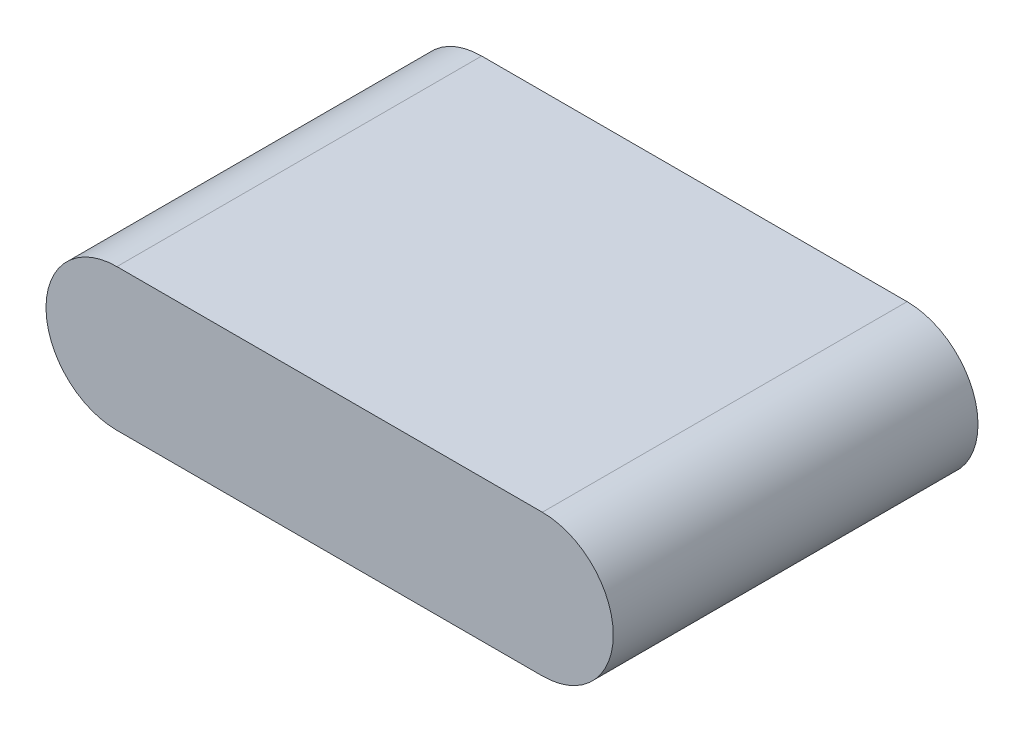
ISO-10303-21;
HEADER;
FILE_DESCRIPTION(('STEP AP214'),'2;1');
FILE_NAME('part.step','',(''),(''),'','','');
FILE_SCHEMA(('AUTOMOTIVE_DESIGN { 1 0 10303 214 1 1 1 1 }'));
ENDSEC;
DATA;
#1=APPLICATION_CONTEXT('core data for automotive mechanical design processes');
#2=APPLICATION_PROTOCOL_DEFINITION('international standard','automotive_design',2000,#1);
#3=PRODUCT_CONTEXT('',#1,'mechanical');
#4=PRODUCT('Part','Part','',(#3));
#5=PRODUCT_RELATED_PRODUCT_CATEGORY('part','',(#4));
#6=PRODUCT_DEFINITION_FORMATION('','',#4);
#7=PRODUCT_DEFINITION_CONTEXT('part definition',#1,'design');
#8=PRODUCT_DEFINITION('design','',#6,#7);
#9=PRODUCT_DEFINITION_SHAPE('','',#8);
#10=(LENGTH_UNIT() NAMED_UNIT(*) SI_UNIT(.MILLI.,.METRE.));
#11=(NAMED_UNIT(*) PLANE_ANGLE_UNIT() SI_UNIT($,.RADIAN.));
#12=(NAMED_UNIT(*) SI_UNIT($,.STERADIAN.) SOLID_ANGLE_UNIT());
#13=UNCERTAINTY_MEASURE_WITH_UNIT(LENGTH_MEASURE(1.E-05),#10,'distance_accuracy_value','');
#14=(GEOMETRIC_REPRESENTATION_CONTEXT(3) GLOBAL_UNCERTAINTY_ASSIGNED_CONTEXT((#13)) GLOBAL_UNIT_ASSIGNED_CONTEXT((#10,
#11,#12)) REPRESENTATION_CONTEXT('',''));
#15=CARTESIAN_POINT('',(0.,0.,0.));
#16=DIRECTION('',(0.,0.,1.));
#17=DIRECTION('',(1.,0.,0.));
#18=AXIS2_PLACEMENT_3D('',#15,#16,#17);
#19=CARTESIAN_POINT('',(5.427379671097,3.510809463321,0.));
#20=DIRECTION('',(0.,1.,0.));
#21=DIRECTION('',(0.,0.,1.));
#22=AXIS2_PLACEMENT_3D('',#19,#20,#21);
#23=PLANE('',#22);
#24=DIRECTION('',(1.,0.,0.));
#25=VECTOR('',#24,1.);
#26=CARTESIAN_POINT('',(5.369059671097,3.510809463321,0.1));
#27=LINE('',#26,#25);
#28=CARTESIAN_POINT('',(5.427379671097,3.510809463321,0.1));
#29=VERTEX_POINT('',#28);
#30=CARTESIAN_POINT('',(5.310739671097,3.510809463321,0.1));
#31=VERTEX_POINT('',#30);
#32=EDGE_CURVE('E84',#29,#31,#27,.F.);
#33=ORIENTED_EDGE('',*,*,#32,.F.);
#34=DIRECTION('',(0.,0.,1.));
#35=VECTOR('',#34,1.);
#36=CARTESIAN_POINT('',(5.427379671097,3.510809463321,0.));
#37=LINE('',#36,#35);
#38=CARTESIAN_POINT('',(5.427379671097,3.510809463321,0.));
#39=VERTEX_POINT('',#38);
#40=EDGE_CURVE('E64',#39,#29,#37,.T.);
#41=ORIENTED_EDGE('',*,*,#40,.F.);
#42=DIRECTION('',(1.,0.,0.));
#43=VECTOR('',#42,1.);
#44=CARTESIAN_POINT('',(5.369059671097,3.510809463321,0.));
#45=LINE('',#44,#43);
#46=CARTESIAN_POINT('',(5.310739671097,3.510809463321,0.));
#47=VERTEX_POINT('',#46);
#48=EDGE_CURVE('E61',#39,#47,#45,.F.);
#49=ORIENTED_EDGE('',*,*,#48,.T.);
#50=DIRECTION('',(0.,0.,1.));
#51=VECTOR('',#50,1.);
#52=CARTESIAN_POINT('',(5.310739671097,3.510809463321,0.));
#53=LINE('',#52,#51);
#54=EDGE_CURVE('E74',#31,#47,#53,.F.);
#55=ORIENTED_EDGE('',*,*,#54,.F.);
#56=EDGE_LOOP('',(#33,#41,#49,#55));
#57=FACE_BOUND('',#56,.T.);
#58=ADVANCED_FACE('F17',(#57),#23,.T.);
#59=CARTESIAN_POINT('',(5.369059671097,3.491369463321,0.));
#60=DIRECTION('',(0.,0.,1.));
#61=DIRECTION('',(1.,0.,0.));
#62=AXIS2_PLACEMENT_3D('',#59,#60,#61);
#63=PLANE('',#62);
#64=DIRECTION('',(1.,0.,0.));
#65=VECTOR('',#64,1.);
#66=CARTESIAN_POINT('',(5.310739671097,3.471929463321,0.));
#67=LINE('',#66,#65);
#68=CARTESIAN_POINT('',(5.310739671097,3.471929463321,0.));
#69=VERTEX_POINT('',#68);
#70=CARTESIAN_POINT('',(5.427379671097,3.471929463321,0.));
#71=VERTEX_POINT('',#70);
#72=EDGE_CURVE('E59',#69,#71,#67,.T.);
#73=ORIENTED_EDGE('',*,*,#72,.F.);
#74=CARTESIAN_POINT('',(5.310739671097,3.491369463321,0.));
#75=DIRECTION('',(0.,0.,1.));
#76=DIRECTION('',(1.,0.,0.));
#77=AXIS2_PLACEMENT_3D('',#74,#75,#76);
#78=CIRCLE('',#77,0.01944);
#79=EDGE_CURVE('E83',#47,#69,#78,.T.);
#80=ORIENTED_EDGE('',*,*,#79,.F.);
#81=ORIENTED_EDGE('',*,*,#48,.F.);
#82=CARTESIAN_POINT('',(5.427379671097,3.491369463321,0.));
#83=DIRECTION('',(0.,0.,1.));
#84=DIRECTION('',(1.,0.,0.));
#85=AXIS2_PLACEMENT_3D('',#82,#83,#84);
#86=CIRCLE('',#85,0.01944);
#87=EDGE_CURVE('E20',#71,#39,#86,.T.);
#88=ORIENTED_EDGE('',*,*,#87,.F.);
#89=EDGE_LOOP('',(#73,#80,#81,#88));
#90=FACE_BOUND('',#89,.T.);
#91=ADVANCED_FACE('F56',(#90),#63,.F.);
#92=CARTESIAN_POINT('',(5.427379671097,3.491369463321,0.));
#93=DIRECTION('',(0.,0.,1.));
#94=DIRECTION('',(1.,0.,0.));
#95=AXIS2_PLACEMENT_3D('',#92,#93,#94);
#96=CYLINDRICAL_SURFACE('',#95,0.01944);
#97=CARTESIAN_POINT('',(5.427379671097,3.491369463321,0.1));
#98=DIRECTION('',(0.,0.,1.));
#99=DIRECTION('',(1.,0.,0.));
#100=AXIS2_PLACEMENT_3D('',#97,#98,#99);
#101=CIRCLE('',#100,0.01944);
#102=CARTESIAN_POINT('',(5.427379671097,3.471929463321,0.1));
#103=VERTEX_POINT('',#102);
#104=EDGE_CURVE('E69',#103,#29,#101,.T.);
#105=ORIENTED_EDGE('',*,*,#104,.F.);
#106=DIRECTION('',(0.,0.,-1.));
#107=VECTOR('',#106,1.);
#108=CARTESIAN_POINT('',(5.427379671097,3.471929463321,0.));
#109=LINE('',#108,#107);
#110=EDGE_CURVE('E66',#71,#103,#109,.F.);
#111=ORIENTED_EDGE('',*,*,#110,.F.);
#112=ORIENTED_EDGE('',*,*,#87,.T.);
#113=ORIENTED_EDGE('',*,*,#40,.T.);
#114=EDGE_LOOP('',(#105,#111,#112,#113));
#115=FACE_BOUND('',#114,.T.);
#116=ADVANCED_FACE('F67',(#115),#96,.T.);
#117=CARTESIAN_POINT('',(5.369059671097,3.491369463321,0.1));
#118=DIRECTION('',(0.,0.,1.));
#119=DIRECTION('',(1.,0.,0.));
#120=AXIS2_PLACEMENT_3D('',#117,#118,#119);
#121=PLANE('',#120);
#122=CARTESIAN_POINT('',(5.310739671097,3.491369463321,0.1));
#123=DIRECTION('',(0.,0.,1.));
#124=DIRECTION('',(1.,0.,0.));
#125=AXIS2_PLACEMENT_3D('',#122,#123,#124);
#126=CIRCLE('',#125,0.01944);
#127=CARTESIAN_POINT('',(5.310739671097,3.471929463321,0.1));
#128=VERTEX_POINT('',#127);
#129=EDGE_CURVE('E35',#128,#31,#126,.F.);
#130=ORIENTED_EDGE('',*,*,#129,.F.);
#131=DIRECTION('',(1.,0.,0.));
#132=VECTOR('',#131,1.);
#133=CARTESIAN_POINT('',(5.310739671097,3.471929463321,0.1));
#134=LINE('',#133,#132);
#135=EDGE_CURVE('E26',#103,#128,#134,.F.);
#136=ORIENTED_EDGE('',*,*,#135,.F.);
#137=ORIENTED_EDGE('',*,*,#104,.T.);
#138=ORIENTED_EDGE('',*,*,#32,.T.);
#139=EDGE_LOOP('',(#130,#136,#137,#138));
#140=FACE_BOUND('',#139,.T.);
#141=ADVANCED_FACE('F88',(#140),#121,.T.);
#142=CARTESIAN_POINT('',(5.310739671097,3.491369463321,0.));
#143=DIRECTION('',(0.,0.,1.));
#144=DIRECTION('',(1.,0.,0.));
#145=AXIS2_PLACEMENT_3D('',#142,#143,#144);
#146=CYLINDRICAL_SURFACE('',#145,0.01944);
#147=ORIENTED_EDGE('',*,*,#129,.T.);
#148=ORIENTED_EDGE('',*,*,#54,.T.);
#149=ORIENTED_EDGE('',*,*,#79,.T.);
#150=DIRECTION('',(0.,0.,-1.));
#151=VECTOR('',#150,1.);
#152=CARTESIAN_POINT('',(5.310739671097,3.471929463321,0.));
#153=LINE('',#152,#151);
#154=EDGE_CURVE('E11',#128,#69,#153,.T.);
#155=ORIENTED_EDGE('',*,*,#154,.F.);
#156=EDGE_LOOP('',(#147,#148,#149,#155));
#157=FACE_BOUND('',#156,.T.);
#158=ADVANCED_FACE('F90',(#157),#146,.T.);
#159=CARTESIAN_POINT('',(5.310739671097,3.471929463321,0.));
#160=DIRECTION('',(0.,-1.,0.));
#161=DIRECTION('',(0.,0.,-1.));
#162=AXIS2_PLACEMENT_3D('',#159,#160,#161);
#163=PLANE('',#162);
#164=ORIENTED_EDGE('',*,*,#135,.T.);
#165=ORIENTED_EDGE('',*,*,#154,.T.);
#166=ORIENTED_EDGE('',*,*,#72,.T.);
#167=ORIENTED_EDGE('',*,*,#110,.T.);
#168=EDGE_LOOP('',(#164,#165,#166,#167));
#169=FACE_BOUND('',#168,.T.);
#170=ADVANCED_FACE('F73',(#169),#163,.T.);
#171=CLOSED_SHELL('',(#58,#91,#116,#141,#158,#170));
#172=MANIFOLD_SOLID_BREP('B1',#171);
#173=ADVANCED_BREP_SHAPE_REPRESENTATION('',(#18,#172),#14);
#174=SHAPE_DEFINITION_REPRESENTATION(#9,#173);
ENDSEC;
END-ISO-10303-21;
